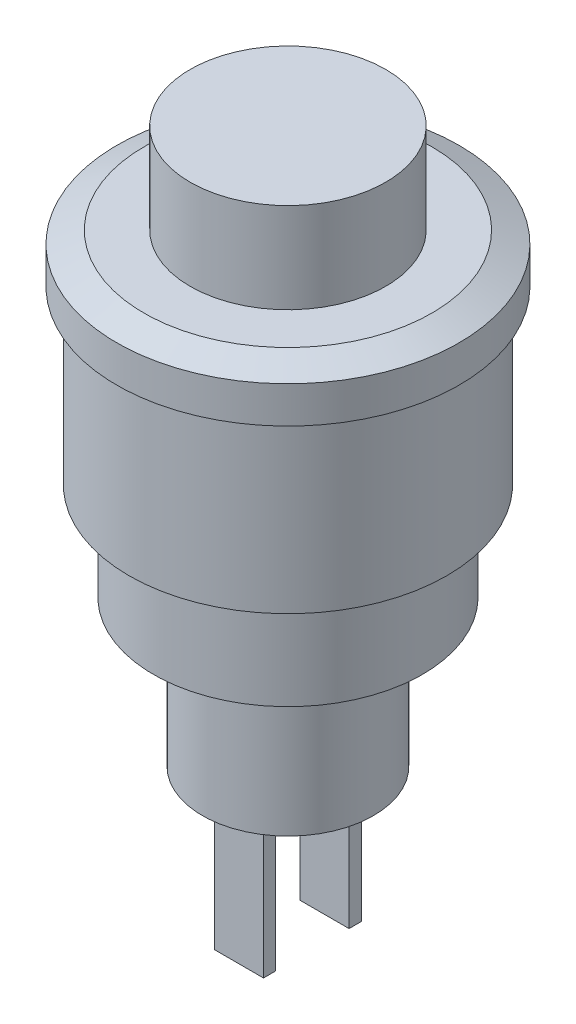
ISO-10303-21;
HEADER;
FILE_DESCRIPTION(('STEP AP214'),'2;1');
FILE_NAME('part.step','',(''),(''),'','','');
FILE_SCHEMA(('AUTOMOTIVE_DESIGN { 1 0 10303 214 1 1 1 1 }'));
ENDSEC;
DATA;
#1=APPLICATION_CONTEXT('core data for automotive mechanical design processes');
#2=APPLICATION_PROTOCOL_DEFINITION('international standard','automotive_design',2000,#1);
#3=PRODUCT_CONTEXT('',#1,'mechanical');
#4=PRODUCT('Part','Part','',(#3));
#5=PRODUCT_RELATED_PRODUCT_CATEGORY('part','',(#4));
#6=PRODUCT_DEFINITION_FORMATION('','',#4);
#7=PRODUCT_DEFINITION_CONTEXT('part definition',#1,'design');
#8=PRODUCT_DEFINITION('design','',#6,#7);
#9=PRODUCT_DEFINITION_SHAPE('','',#8);
#10=(LENGTH_UNIT() NAMED_UNIT(*) SI_UNIT(.MILLI.,.METRE.));
#11=(NAMED_UNIT(*) PLANE_ANGLE_UNIT() SI_UNIT($,.RADIAN.));
#12=(NAMED_UNIT(*) SI_UNIT($,.STERADIAN.) SOLID_ANGLE_UNIT());
#13=UNCERTAINTY_MEASURE_WITH_UNIT(LENGTH_MEASURE(1.E-05),#10,'distance_accuracy_value','');
#14=(GEOMETRIC_REPRESENTATION_CONTEXT(3) GLOBAL_UNCERTAINTY_ASSIGNED_CONTEXT((#13)) GLOBAL_UNIT_ASSIGNED_CONTEXT((#10,
#11,#12)) REPRESENTATION_CONTEXT('',''));
#15=CARTESIAN_POINT('',(0.,0.,0.));
#16=DIRECTION('',(0.,0.,1.));
#17=DIRECTION('',(1.,0.,0.));
#18=AXIS2_PLACEMENT_3D('',#15,#16,#17);
#19=CARTESIAN_POINT('',(3.5,0.,0.));
#20=DIRECTION('',(0.,-1.,0.));
#21=DIRECTION('',(0.,0.,-1.));
#22=AXIS2_PLACEMENT_3D('',#19,#20,#21);
#23=PLANE('',#22);
#24=CARTESIAN_POINT('',(0.,0.,0.));
#25=DIRECTION('',(0.,-1.,0.));
#26=DIRECTION('',(0.,0.,-1.));
#27=AXIS2_PLACEMENT_3D('',#24,#25,#26);
#28=CIRCLE('',#27,3.5);
#29=CARTESIAN_POINT('',(0.,0.,-3.5));
#30=VERTEX_POINT('',#29);
#31=EDGE_CURVE('E156',#30,#30,#28,.T.);
#32=ORIENTED_EDGE('',*,*,#31,.T.);
#33=EDGE_LOOP('',(#32));
#34=FACE_BOUND('',#33,.T.);
#35=DIRECTION('',(-1.,0.,0.));
#36=VECTOR('',#35,1.);
#37=CARTESIAN_POINT('',(1.,0.,-1.5));
#38=LINE('',#37,#36);
#39=CARTESIAN_POINT('',(1.,0.,-1.5));
#40=VERTEX_POINT('',#39);
#41=CARTESIAN_POINT('',(-1.,0.,-1.5));
#42=VERTEX_POINT('',#41);
#43=EDGE_CURVE('E128',#40,#42,#38,.T.);
#44=ORIENTED_EDGE('',*,*,#43,.F.);
#45=DIRECTION('',(0.,0.,1.));
#46=VECTOR('',#45,1.);
#47=CARTESIAN_POINT('',(1.,0.,-1.5));
#48=LINE('',#47,#46);
#49=CARTESIAN_POINT('',(1.,0.,-2.));
#50=VERTEX_POINT('',#49);
#51=EDGE_CURVE('E125',#50,#40,#48,.T.);
#52=ORIENTED_EDGE('',*,*,#51,.F.);
#53=DIRECTION('',(1.,0.,0.));
#54=VECTOR('',#53,1.);
#55=CARTESIAN_POINT('',(1.,0.,-2.));
#56=LINE('',#55,#54);
#57=CARTESIAN_POINT('',(-1.,0.,-2.));
#58=VERTEX_POINT('',#57);
#59=EDGE_CURVE('E137',#58,#50,#56,.T.);
#60=ORIENTED_EDGE('',*,*,#59,.F.);
#61=DIRECTION('',(0.,0.,-1.));
#62=VECTOR('',#61,1.);
#63=CARTESIAN_POINT('',(-1.,0.,-1.5));
#64=LINE('',#63,#62);
#65=EDGE_CURVE('E145',#42,#58,#64,.T.);
#66=ORIENTED_EDGE('',*,*,#65,.F.);
#67=EDGE_LOOP('',(#44,#52,#60,#66));
#68=FACE_BOUND('',#67,.T.);
#69=DIRECTION('',(-1.,0.,0.));
#70=VECTOR('',#69,1.);
#71=CARTESIAN_POINT('',(1.,0.,2.));
#72=LINE('',#71,#70);
#73=CARTESIAN_POINT('',(1.,0.,2.));
#74=VERTEX_POINT('',#73);
#75=CARTESIAN_POINT('',(-1.,0.,2.));
#76=VERTEX_POINT('',#75);
#77=EDGE_CURVE('E423',#74,#76,#72,.T.);
#78=ORIENTED_EDGE('',*,*,#77,.F.);
#79=DIRECTION('',(0.,0.,1.));
#80=VECTOR('',#79,1.);
#81=CARTESIAN_POINT('',(1.,0.,1.5));
#82=LINE('',#81,#80);
#83=CARTESIAN_POINT('',(1.,0.,1.5));
#84=VERTEX_POINT('',#83);
#85=EDGE_CURVE('E123',#84,#74,#82,.T.);
#86=ORIENTED_EDGE('',*,*,#85,.F.);
#87=DIRECTION('',(1.,0.,0.));
#88=VECTOR('',#87,1.);
#89=CARTESIAN_POINT('',(1.,0.,1.5));
#90=LINE('',#89,#88);
#91=CARTESIAN_POINT('',(-1.,0.,1.5));
#92=VERTEX_POINT('',#91);
#93=EDGE_CURVE('E119',#92,#84,#90,.T.);
#94=ORIENTED_EDGE('',*,*,#93,.F.);
#95=DIRECTION('',(0.,0.,-1.));
#96=VECTOR('',#95,1.);
#97=CARTESIAN_POINT('',(-1.,0.,1.5));
#98=LINE('',#97,#96);
#99=EDGE_CURVE('E420',#76,#92,#98,.T.);
#100=ORIENTED_EDGE('',*,*,#99,.F.);
#101=EDGE_LOOP('',(#78,#86,#94,#100));
#102=FACE_BOUND('',#101,.T.);
#103=ADVANCED_FACE('F34',(#34,#68,#102),#23,.T.);
#104=CARTESIAN_POINT('',(0.,22.6897645130844,0.));
#105=DIRECTION('',(0.,1.,0.));
#106=DIRECTION('',(0.,0.,1.));
#107=AXIS2_PLACEMENT_3D('',#104,#105,#106);
#108=PLANE('',#107);
#109=CARTESIAN_POINT('',(0.,22.6897645130844,0.));
#110=DIRECTION('',(0.,-1.,0.));
#111=DIRECTION('',(0.,0.,-1.));
#112=AXIS2_PLACEMENT_3D('',#109,#110,#111);
#113=CIRCLE('',#112,4.);
#114=CARTESIAN_POINT('',(0.,22.6897645130844,-4.));
#115=VERTEX_POINT('',#114);
#116=EDGE_CURVE('E11',#115,#115,#113,.T.);
#117=ORIENTED_EDGE('',*,*,#116,.F.);
#118=EDGE_LOOP('',(#117));
#119=FACE_BOUND('',#118,.T.);
#120=ADVANCED_FACE('F36',(#119),#108,.T.);
#121=CARTESIAN_POINT('',(0.,0.,0.));
#122=DIRECTION('',(0.,-1.,0.));
#123=DIRECTION('',(0.,0.,-1.));
#124=AXIS2_PLACEMENT_3D('',#121,#122,#123);
#125=CYLINDRICAL_SURFACE('',#124,4.);
#126=ORIENTED_EDGE('',*,*,#116,.T.);
#127=EDGE_LOOP('',(#126));
#128=FACE_BOUND('',#127,.T.);
#129=CARTESIAN_POINT('',(0.,19.,0.));
#130=DIRECTION('',(0.,-1.,0.));
#131=DIRECTION('',(0.,0.,-1.));
#132=AXIS2_PLACEMENT_3D('',#129,#130,#131);
#133=CIRCLE('',#132,4.);
#134=CARTESIAN_POINT('',(0.,19.,-4.));
#135=VERTEX_POINT('',#134);
#136=EDGE_CURVE('E42',#135,#135,#133,.T.);
#137=ORIENTED_EDGE('',*,*,#136,.F.);
#138=EDGE_LOOP('',(#137));
#139=FACE_BOUND('',#138,.T.);
#140=ADVANCED_FACE('F188',(#128,#139),#125,.T.);
#141=CARTESIAN_POINT('',(4.,19.,0.));
#142=DIRECTION('',(0.,1.,0.));
#143=DIRECTION('',(0.,0.,1.));
#144=AXIS2_PLACEMENT_3D('',#141,#142,#143);
#145=PLANE('',#144);
#146=ORIENTED_EDGE('',*,*,#136,.T.);
#147=EDGE_LOOP('',(#146));
#148=FACE_BOUND('',#147,.T.);
#149=CARTESIAN_POINT('',(0.,19.,0.));
#150=DIRECTION('',(0.,-1.,0.));
#151=DIRECTION('',(0.,0.,-1.));
#152=AXIS2_PLACEMENT_3D('',#149,#150,#151);
#153=CIRCLE('',#152,5.89130434782607);
#154=CARTESIAN_POINT('',(0.,19.,-5.89130434782607));
#155=VERTEX_POINT('',#154);
#156=EDGE_CURVE('E180',#155,#155,#153,.T.);
#157=ORIENTED_EDGE('',*,*,#156,.F.);
#158=EDGE_LOOP('',(#157));
#159=FACE_BOUND('',#158,.T.);
#160=ADVANCED_FACE('F185',(#148,#159),#145,.T.);
#161=CARTESIAN_POINT('',(0.,18.5,0.));
#162=DIRECTION('',(0.,-1.,0.));
#163=DIRECTION('',(0.,0.,-1.));
#164=AXIS2_PLACEMENT_3D('',#161,#162,#163);
#165=CONICAL_SURFACE('',#164,7.,1.14712740491739);
#166=ORIENTED_EDGE('',*,*,#156,.T.);
#167=EDGE_LOOP('',(#166));
#168=FACE_BOUND('',#167,.T.);
#169=CARTESIAN_POINT('',(0.,18.5,0.));
#170=DIRECTION('',(0.,-1.,0.));
#171=DIRECTION('',(0.,0.,-1.));
#172=AXIS2_PLACEMENT_3D('',#169,#170,#171);
#173=CIRCLE('',#172,7.);
#174=CARTESIAN_POINT('',(0.,18.5,-7.));
#175=VERTEX_POINT('',#174);
#176=EDGE_CURVE('E177',#175,#175,#173,.T.);
#177=ORIENTED_EDGE('',*,*,#176,.F.);
#178=EDGE_LOOP('',(#177));
#179=FACE_BOUND('',#178,.T.);
#180=ADVANCED_FACE('F195',(#168,#179),#165,.T.);
#181=CARTESIAN_POINT('',(0.,0.,0.));
#182=DIRECTION('',(0.,-1.,0.));
#183=DIRECTION('',(0.,0.,-1.));
#184=AXIS2_PLACEMENT_3D('',#181,#182,#183);
#185=CYLINDRICAL_SURFACE('',#184,7.);
#186=ORIENTED_EDGE('',*,*,#176,.T.);
#187=EDGE_LOOP('',(#186));
#188=FACE_BOUND('',#187,.T.);
#189=CARTESIAN_POINT('',(0.,17.,0.));
#190=DIRECTION('',(0.,-1.,0.));
#191=DIRECTION('',(0.,0.,-1.));
#192=AXIS2_PLACEMENT_3D('',#189,#190,#191);
#193=CIRCLE('',#192,7.);
#194=CARTESIAN_POINT('',(0.,17.,-7.));
#195=VERTEX_POINT('',#194);
#196=EDGE_CURVE('E174',#195,#195,#193,.T.);
#197=ORIENTED_EDGE('',*,*,#196,.F.);
#198=EDGE_LOOP('',(#197));
#199=FACE_BOUND('',#198,.T.);
#200=ADVANCED_FACE('F231',(#188,#199),#185,.T.);
#201=CARTESIAN_POINT('',(7.,17.,0.));
#202=DIRECTION('',(0.,-1.,0.));
#203=DIRECTION('',(0.,0.,-1.));
#204=AXIS2_PLACEMENT_3D('',#201,#202,#203);
#205=PLANE('',#204);
#206=ORIENTED_EDGE('',*,*,#196,.T.);
#207=EDGE_LOOP('',(#206));
#208=FACE_BOUND('',#207,.T.);
#209=CARTESIAN_POINT('',(0.,17.,0.));
#210=DIRECTION('',(0.,-1.,0.));
#211=DIRECTION('',(0.,0.,-1.));
#212=AXIS2_PLACEMENT_3D('',#209,#210,#211);
#213=CIRCLE('',#212,6.5);
#214=CARTESIAN_POINT('',(0.,17.,-6.5));
#215=VERTEX_POINT('',#214);
#216=EDGE_CURVE('E171',#215,#215,#213,.T.);
#217=ORIENTED_EDGE('',*,*,#216,.F.);
#218=EDGE_LOOP('',(#217));
#219=FACE_BOUND('',#218,.T.);
#220=ADVANCED_FACE('F227',(#208,#219),#205,.T.);
#221=CARTESIAN_POINT('',(0.,0.,0.));
#222=DIRECTION('',(0.,-1.,0.));
#223=DIRECTION('',(0.,0.,-1.));
#224=AXIS2_PLACEMENT_3D('',#221,#222,#223);
#225=CYLINDRICAL_SURFACE('',#224,6.5);
#226=ORIENTED_EDGE('',*,*,#216,.T.);
#227=EDGE_LOOP('',(#226));
#228=FACE_BOUND('',#227,.T.);
#229=CARTESIAN_POINT('',(0.,10.,0.));
#230=DIRECTION('',(0.,-1.,0.));
#231=DIRECTION('',(0.,0.,-1.));
#232=AXIS2_PLACEMENT_3D('',#229,#230,#231);
#233=CIRCLE('',#232,6.5);
#234=CARTESIAN_POINT('',(0.,10.,-6.5));
#235=VERTEX_POINT('',#234);
#236=EDGE_CURVE('E168',#235,#235,#233,.T.);
#237=ORIENTED_EDGE('',*,*,#236,.F.);
#238=EDGE_LOOP('',(#237));
#239=FACE_BOUND('',#238,.T.);
#240=ADVANCED_FACE('F223',(#228,#239),#225,.T.);
#241=CARTESIAN_POINT('',(6.5,10.,0.));
#242=DIRECTION('',(0.,-1.,0.));
#243=DIRECTION('',(0.,0.,-1.));
#244=AXIS2_PLACEMENT_3D('',#241,#242,#243);
#245=PLANE('',#244);
#246=ORIENTED_EDGE('',*,*,#236,.T.);
#247=EDGE_LOOP('',(#246));
#248=FACE_BOUND('',#247,.T.);
#249=CARTESIAN_POINT('',(0.,10.,0.));
#250=DIRECTION('',(0.,-1.,0.));
#251=DIRECTION('',(0.,0.,-1.));
#252=AXIS2_PLACEMENT_3D('',#249,#250,#251);
#253=CIRCLE('',#252,5.5);
#254=CARTESIAN_POINT('',(0.,10.,-5.5));
#255=VERTEX_POINT('',#254);
#256=EDGE_CURVE('E165',#255,#255,#253,.T.);
#257=ORIENTED_EDGE('',*,*,#256,.F.);
#258=EDGE_LOOP('',(#257));
#259=FACE_BOUND('',#258,.T.);
#260=ADVANCED_FACE('F219',(#248,#259),#245,.T.);
#261=CARTESIAN_POINT('',(0.,0.,0.));
#262=DIRECTION('',(0.,-1.,0.));
#263=DIRECTION('',(0.,0.,-1.));
#264=AXIS2_PLACEMENT_3D('',#261,#262,#263);
#265=CYLINDRICAL_SURFACE('',#264,5.5);
#266=ORIENTED_EDGE('',*,*,#256,.T.);
#267=EDGE_LOOP('',(#266));
#268=FACE_BOUND('',#267,.T.);
#269=CARTESIAN_POINT('',(0.,6.,0.));
#270=DIRECTION('',(0.,-1.,0.));
#271=DIRECTION('',(0.,0.,-1.));
#272=AXIS2_PLACEMENT_3D('',#269,#270,#271);
#273=CIRCLE('',#272,5.5);
#274=CARTESIAN_POINT('',(0.,6.,-5.5));
#275=VERTEX_POINT('',#274);
#276=EDGE_CURVE('E162',#275,#275,#273,.T.);
#277=ORIENTED_EDGE('',*,*,#276,.F.);
#278=EDGE_LOOP('',(#277));
#279=FACE_BOUND('',#278,.T.);
#280=ADVANCED_FACE('F215',(#268,#279),#265,.T.);
#281=CARTESIAN_POINT('',(5.5,6.,0.));
#282=DIRECTION('',(0.,-1.,0.));
#283=DIRECTION('',(0.,0.,-1.));
#284=AXIS2_PLACEMENT_3D('',#281,#282,#283);
#285=PLANE('',#284);
#286=ORIENTED_EDGE('',*,*,#276,.T.);
#287=EDGE_LOOP('',(#286));
#288=FACE_BOUND('',#287,.T.);
#289=CARTESIAN_POINT('',(0.,6.,0.));
#290=DIRECTION('',(0.,-1.,0.));
#291=DIRECTION('',(0.,0.,-1.));
#292=AXIS2_PLACEMENT_3D('',#289,#290,#291);
#293=CIRCLE('',#292,3.5);
#294=CARTESIAN_POINT('',(0.,6.,-3.5));
#295=VERTEX_POINT('',#294);
#296=EDGE_CURVE('E159',#295,#295,#293,.T.);
#297=ORIENTED_EDGE('',*,*,#296,.F.);
#298=EDGE_LOOP('',(#297));
#299=FACE_BOUND('',#298,.T.);
#300=ADVANCED_FACE('F211',(#288,#299),#285,.T.);
#301=CARTESIAN_POINT('',(0.,0.,0.));
#302=DIRECTION('',(0.,-1.,0.));
#303=DIRECTION('',(0.,0.,-1.));
#304=AXIS2_PLACEMENT_3D('',#301,#302,#303);
#305=CYLINDRICAL_SURFACE('',#304,3.5);
#306=ORIENTED_EDGE('',*,*,#296,.T.);
#307=EDGE_LOOP('',(#306));
#308=FACE_BOUND('',#307,.T.);
#309=ORIENTED_EDGE('',*,*,#31,.F.);
#310=EDGE_LOOP('',(#309));
#311=FACE_BOUND('',#310,.T.);
#312=ADVANCED_FACE('F208',(#308,#311),#305,.T.);
#313=CARTESIAN_POINT('',(1.,-6.,-1.5));
#314=DIRECTION('',(-1.,0.,0.));
#315=DIRECTION('',(0.,0.,1.));
#316=AXIS2_PLACEMENT_3D('',#313,#314,#315);
#317=PLANE('',#316);
#318=ORIENTED_EDGE('',*,*,#51,.T.);
#319=DIRECTION('',(0.,1.,0.));
#320=VECTOR('',#319,1.);
#321=CARTESIAN_POINT('',(1.,-6.,-1.5));
#322=LINE('',#321,#320);
#323=CARTESIAN_POINT('',(1.,-6.,-1.5));
#324=VERTEX_POINT('',#323);
#325=EDGE_CURVE('E154',#324,#40,#322,.T.);
#326=ORIENTED_EDGE('',*,*,#325,.F.);
#327=DIRECTION('',(0.,0.,1.));
#328=VECTOR('',#327,1.);
#329=CARTESIAN_POINT('',(1.,-6.,-1.5));
#330=LINE('',#329,#328);
#331=CARTESIAN_POINT('',(1.,-6.,-2.));
#332=VERTEX_POINT('',#331);
#333=EDGE_CURVE('E133',#332,#324,#330,.T.);
#334=ORIENTED_EDGE('',*,*,#333,.F.);
#335=DIRECTION('',(0.,1.,0.));
#336=VECTOR('',#335,1.);
#337=CARTESIAN_POINT('',(1.,-6.,-2.));
#338=LINE('',#337,#336);
#339=EDGE_CURVE('E142',#332,#50,#338,.T.);
#340=ORIENTED_EDGE('',*,*,#339,.T.);
#341=EDGE_LOOP('',(#318,#326,#334,#340));
#342=FACE_BOUND('',#341,.T.);
#343=ADVANCED_FACE('F206',(#342),#317,.F.);
#344=CARTESIAN_POINT('',(1.,-6.,-1.5));
#345=DIRECTION('',(0.,0.,-1.));
#346=DIRECTION('',(-1.,0.,0.));
#347=AXIS2_PLACEMENT_3D('',#344,#345,#346);
#348=PLANE('',#347);
#349=ORIENTED_EDGE('',*,*,#43,.T.);
#350=DIRECTION('',(0.,1.,0.));
#351=VECTOR('',#350,1.);
#352=CARTESIAN_POINT('',(-1.,-6.,-1.5));
#353=LINE('',#352,#351);
#354=CARTESIAN_POINT('',(-1.,-6.,-1.5));
#355=VERTEX_POINT('',#354);
#356=EDGE_CURVE('E151',#355,#42,#353,.T.);
#357=ORIENTED_EDGE('',*,*,#356,.F.);
#358=DIRECTION('',(-1.,0.,0.));
#359=VECTOR('',#358,1.);
#360=CARTESIAN_POINT('',(1.,-6.,-1.5));
#361=LINE('',#360,#359);
#362=EDGE_CURVE('E136',#324,#355,#361,.T.);
#363=ORIENTED_EDGE('',*,*,#362,.F.);
#364=ORIENTED_EDGE('',*,*,#325,.T.);
#365=EDGE_LOOP('',(#349,#357,#363,#364));
#366=FACE_BOUND('',#365,.T.);
#367=ADVANCED_FACE('F293',(#366),#348,.F.);
#368=CARTESIAN_POINT('',(-1.,-6.,-1.5));
#369=DIRECTION('',(1.,0.,0.));
#370=DIRECTION('',(0.,0.,-1.));
#371=AXIS2_PLACEMENT_3D('',#368,#369,#370);
#372=PLANE('',#371);
#373=ORIENTED_EDGE('',*,*,#65,.T.);
#374=DIRECTION('',(0.,1.,0.));
#375=VECTOR('',#374,1.);
#376=CARTESIAN_POINT('',(-1.,-6.,-2.));
#377=LINE('',#376,#375);
#378=CARTESIAN_POINT('',(-1.,-6.,-2.));
#379=VERTEX_POINT('',#378);
#380=EDGE_CURVE('E57',#379,#58,#377,.T.);
#381=ORIENTED_EDGE('',*,*,#380,.F.);
#382=DIRECTION('',(0.,0.,-1.));
#383=VECTOR('',#382,1.);
#384=CARTESIAN_POINT('',(-1.,-6.,-1.5));
#385=LINE('',#384,#383);
#386=EDGE_CURVE('E139',#355,#379,#385,.T.);
#387=ORIENTED_EDGE('',*,*,#386,.F.);
#388=ORIENTED_EDGE('',*,*,#356,.T.);
#389=EDGE_LOOP('',(#373,#381,#387,#388));
#390=FACE_BOUND('',#389,.T.);
#391=ADVANCED_FACE('F300',(#390),#372,.F.);
#392=CARTESIAN_POINT('',(1.,-6.,-2.));
#393=DIRECTION('',(0.,0.,1.));
#394=DIRECTION('',(1.,0.,0.));
#395=AXIS2_PLACEMENT_3D('',#392,#393,#394);
#396=PLANE('',#395);
#397=ORIENTED_EDGE('',*,*,#59,.T.);
#398=ORIENTED_EDGE('',*,*,#339,.F.);
#399=DIRECTION('',(1.,0.,0.));
#400=VECTOR('',#399,1.);
#401=CARTESIAN_POINT('',(1.,-6.,-2.));
#402=LINE('',#401,#400);
#403=EDGE_CURVE('E141',#379,#332,#402,.T.);
#404=ORIENTED_EDGE('',*,*,#403,.F.);
#405=ORIENTED_EDGE('',*,*,#380,.T.);
#406=EDGE_LOOP('',(#397,#398,#404,#405));
#407=FACE_BOUND('',#406,.T.);
#408=ADVANCED_FACE('F307',(#407),#396,.F.);
#409=CARTESIAN_POINT('',(0.,-6.,0.));
#410=DIRECTION('',(0.,1.,0.));
#411=DIRECTION('',(0.,0.,1.));
#412=AXIS2_PLACEMENT_3D('',#409,#410,#411);
#413=PLANE('',#412);
#414=ORIENTED_EDGE('',*,*,#333,.T.);
#415=ORIENTED_EDGE('',*,*,#362,.T.);
#416=ORIENTED_EDGE('',*,*,#386,.T.);
#417=ORIENTED_EDGE('',*,*,#403,.T.);
#418=EDGE_LOOP('',(#414,#415,#416,#417));
#419=FACE_BOUND('',#418,.T.);
#420=ADVANCED_FACE('F315',(#419),#413,.F.);
#421=CARTESIAN_POINT('',(1.,-6.,1.5));
#422=DIRECTION('',(-1.,0.,0.));
#423=DIRECTION('',(0.,0.,1.));
#424=AXIS2_PLACEMENT_3D('',#421,#422,#423);
#425=PLANE('',#424);
#426=ORIENTED_EDGE('',*,*,#85,.T.);
#427=DIRECTION('',(0.,1.,0.));
#428=VECTOR('',#427,1.);
#429=CARTESIAN_POINT('',(1.,-6.,2.));
#430=LINE('',#429,#428);
#431=CARTESIAN_POINT('',(1.,-6.,2.));
#432=VERTEX_POINT('',#431);
#433=EDGE_CURVE('E104',#432,#74,#430,.T.);
#434=ORIENTED_EDGE('',*,*,#433,.F.);
#435=DIRECTION('',(0.,0.,1.));
#436=VECTOR('',#435,1.);
#437=CARTESIAN_POINT('',(1.,-6.,1.5));
#438=LINE('',#437,#436);
#439=CARTESIAN_POINT('',(1.,-6.,1.5));
#440=VERTEX_POINT('',#439);
#441=EDGE_CURVE('E111',#440,#432,#438,.T.);
#442=ORIENTED_EDGE('',*,*,#441,.F.);
#443=DIRECTION('',(0.,1.,0.));
#444=VECTOR('',#443,1.);
#445=CARTESIAN_POINT('',(1.,-6.,1.5));
#446=LINE('',#445,#444);
#447=EDGE_CURVE('E417',#440,#84,#446,.T.);
#448=ORIENTED_EDGE('',*,*,#447,.T.);
#449=EDGE_LOOP('',(#426,#434,#442,#448));
#450=FACE_BOUND('',#449,.T.);
#451=ADVANCED_FACE('F121',(#450),#425,.F.);
#452=CARTESIAN_POINT('',(1.,-6.,2.));
#453=DIRECTION('',(0.,0.,-1.));
#454=DIRECTION('',(-1.,0.,0.));
#455=AXIS2_PLACEMENT_3D('',#452,#453,#454);
#456=PLANE('',#455);
#457=ORIENTED_EDGE('',*,*,#77,.T.);
#458=DIRECTION('',(0.,1.,0.));
#459=VECTOR('',#458,1.);
#460=CARTESIAN_POINT('',(-1.,-6.,2.));
#461=LINE('',#460,#459);
#462=CARTESIAN_POINT('',(-1.,-6.,2.));
#463=VERTEX_POINT('',#462);
#464=EDGE_CURVE('E107',#463,#76,#461,.T.);
#465=ORIENTED_EDGE('',*,*,#464,.F.);
#466=DIRECTION('',(-1.,0.,0.));
#467=VECTOR('',#466,1.);
#468=CARTESIAN_POINT('',(1.,-6.,2.));
#469=LINE('',#468,#467);
#470=EDGE_CURVE('E100',#432,#463,#469,.T.);
#471=ORIENTED_EDGE('',*,*,#470,.F.);
#472=ORIENTED_EDGE('',*,*,#433,.T.);
#473=EDGE_LOOP('',(#457,#465,#471,#472));
#474=FACE_BOUND('',#473,.T.);
#475=ADVANCED_FACE('F102',(#474),#456,.F.);
#476=CARTESIAN_POINT('',(-1.,-6.,1.5));
#477=DIRECTION('',(1.,0.,0.));
#478=DIRECTION('',(0.,0.,-1.));
#479=AXIS2_PLACEMENT_3D('',#476,#477,#478);
#480=PLANE('',#479);
#481=ORIENTED_EDGE('',*,*,#99,.T.);
#482=DIRECTION('',(0.,1.,0.));
#483=VECTOR('',#482,1.);
#484=CARTESIAN_POINT('',(-1.,-6.,1.5));
#485=LINE('',#484,#483);
#486=CARTESIAN_POINT('',(-1.,-6.,1.5));
#487=VERTEX_POINT('',#486);
#488=EDGE_CURVE('E49',#487,#92,#485,.T.);
#489=ORIENTED_EDGE('',*,*,#488,.F.);
#490=DIRECTION('',(0.,0.,-1.));
#491=VECTOR('',#490,1.);
#492=CARTESIAN_POINT('',(-1.,-6.,1.5));
#493=LINE('',#492,#491);
#494=EDGE_CURVE('E110',#463,#487,#493,.T.);
#495=ORIENTED_EDGE('',*,*,#494,.F.);
#496=ORIENTED_EDGE('',*,*,#464,.T.);
#497=EDGE_LOOP('',(#481,#489,#495,#496));
#498=FACE_BOUND('',#497,.T.);
#499=ADVANCED_FACE('F335',(#498),#480,.F.);
#500=CARTESIAN_POINT('',(1.,-6.,1.5));
#501=DIRECTION('',(0.,0.,1.));
#502=DIRECTION('',(1.,0.,0.));
#503=AXIS2_PLACEMENT_3D('',#500,#501,#502);
#504=PLANE('',#503);
#505=ORIENTED_EDGE('',*,*,#93,.T.);
#506=ORIENTED_EDGE('',*,*,#447,.F.);
#507=DIRECTION('',(1.,0.,0.));
#508=VECTOR('',#507,1.);
#509=CARTESIAN_POINT('',(1.,-6.,1.5));
#510=LINE('',#509,#508);
#511=EDGE_CURVE('E115',#487,#440,#510,.T.);
#512=ORIENTED_EDGE('',*,*,#511,.F.);
#513=ORIENTED_EDGE('',*,*,#488,.T.);
#514=EDGE_LOOP('',(#505,#506,#512,#513));
#515=FACE_BOUND('',#514,.T.);
#516=ADVANCED_FACE('F342',(#515),#504,.F.);
#517=CARTESIAN_POINT('',(0.,-6.,0.));
#518=DIRECTION('',(0.,-1.,0.));
#519=DIRECTION('',(0.,0.,-1.));
#520=AXIS2_PLACEMENT_3D('',#517,#518,#519);
#521=PLANE('',#520);
#522=ORIENTED_EDGE('',*,*,#441,.T.);
#523=ORIENTED_EDGE('',*,*,#470,.T.);
#524=ORIENTED_EDGE('',*,*,#494,.T.);
#525=ORIENTED_EDGE('',*,*,#511,.T.);
#526=EDGE_LOOP('',(#522,#523,#524,#525));
#527=FACE_BOUND('',#526,.T.);
#528=ADVANCED_FACE('F114',(#527),#521,.T.);
#529=CLOSED_SHELL('',(#103,#120,#140,#160,#180,#200,#220,#240,#260,#280,#300,#312,#343,#367,
#391,#408,#420,#451,#475,#499,#516,#528));
#530=MANIFOLD_SOLID_BREP('B2',#529);
#531=ADVANCED_BREP_SHAPE_REPRESENTATION('',(#18,#530),#14);
#532=SHAPE_DEFINITION_REPRESENTATION(#9,#531);
ENDSEC;
END-ISO-10303-21;
